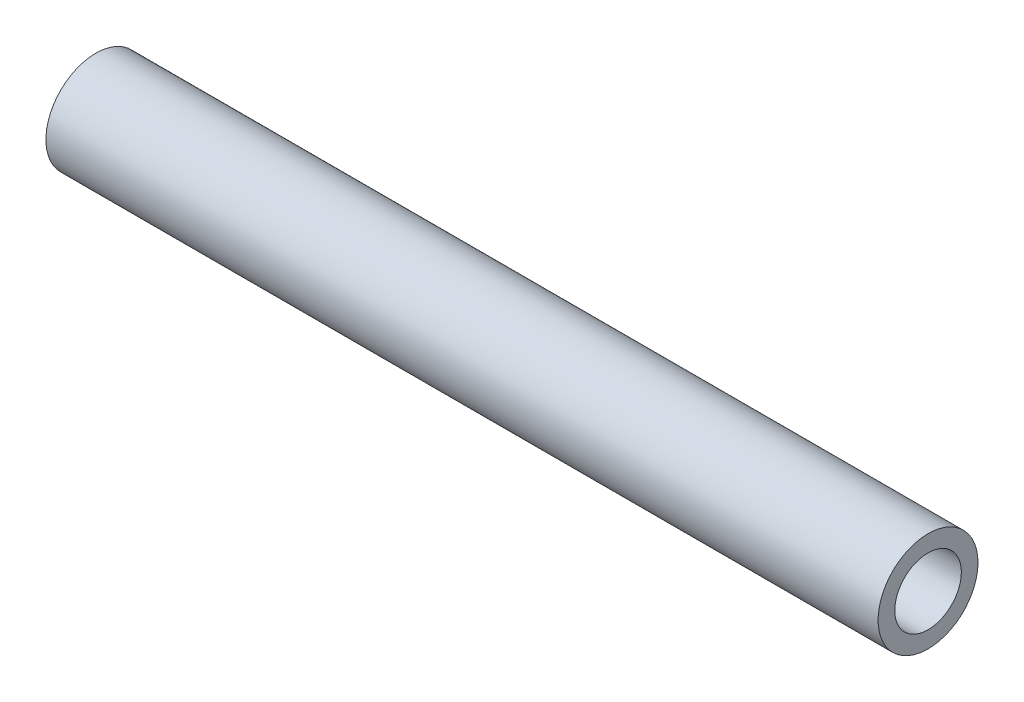
ISO-10303-21;
HEADER;
FILE_DESCRIPTION(('STEP AP214'),'2;1');
FILE_NAME('part.step','',(''),(''),'','','');
FILE_SCHEMA(('AUTOMOTIVE_DESIGN { 1 0 10303 214 1 1 1 1 }'));
ENDSEC;
DATA;
#1=APPLICATION_CONTEXT('core data for automotive mechanical design processes');
#2=APPLICATION_PROTOCOL_DEFINITION('international standard','automotive_design',2000,#1);
#3=PRODUCT_CONTEXT('',#1,'mechanical');
#4=PRODUCT('Part','Part','',(#3));
#5=PRODUCT_RELATED_PRODUCT_CATEGORY('part','',(#4));
#6=PRODUCT_DEFINITION_FORMATION('','',#4);
#7=PRODUCT_DEFINITION_CONTEXT('part definition',#1,'design');
#8=PRODUCT_DEFINITION('design','',#6,#7);
#9=PRODUCT_DEFINITION_SHAPE('','',#8);
#10=(LENGTH_UNIT() NAMED_UNIT(*) SI_UNIT(.MILLI.,.METRE.));
#11=(NAMED_UNIT(*) PLANE_ANGLE_UNIT() SI_UNIT($,.RADIAN.));
#12=(NAMED_UNIT(*) SI_UNIT($,.STERADIAN.) SOLID_ANGLE_UNIT());
#13=UNCERTAINTY_MEASURE_WITH_UNIT(LENGTH_MEASURE(1.E-05),#10,'distance_accuracy_value','');
#14=(GEOMETRIC_REPRESENTATION_CONTEXT(3) GLOBAL_UNCERTAINTY_ASSIGNED_CONTEXT((#13)) GLOBAL_UNIT_ASSIGNED_CONTEXT((#10,
#11,#12)) REPRESENTATION_CONTEXT('',''));
#15=CARTESIAN_POINT('',(0.,0.,0.));
#16=DIRECTION('',(0.,0.,1.));
#17=DIRECTION('',(1.,0.,0.));
#18=AXIS2_PLACEMENT_3D('',#15,#16,#17);
#19=CARTESIAN_POINT('',(50.,0.,0.));
#20=DIRECTION('',(1.,0.,0.));
#21=DIRECTION('',(0.,0.,-1.));
#22=AXIS2_PLACEMENT_3D('',#19,#20,#21);
#23=PLANE('',#22);
#24=CARTESIAN_POINT('',(50.,0.,0.));
#25=DIRECTION('',(1.,0.,0.));
#26=DIRECTION('',(0.,0.,-1.));
#27=AXIS2_PLACEMENT_3D('',#24,#25,#26);
#28=CIRCLE('',#27,6.);
#29=CARTESIAN_POINT('',(50.,0.,-6.));
#30=VERTEX_POINT('',#29);
#31=EDGE_CURVE('E10',#30,#30,#28,.T.);
#32=ORIENTED_EDGE('',*,*,#31,.T.);
#33=EDGE_LOOP('',(#32));
#34=FACE_BOUND('',#33,.T.);
#35=CARTESIAN_POINT('',(50.,0.,0.));
#36=DIRECTION('',(1.,0.,0.));
#37=DIRECTION('',(0.,0.,-1.));
#38=AXIS2_PLACEMENT_3D('',#35,#36,#37);
#39=CIRCLE('',#38,4.);
#40=CARTESIAN_POINT('',(50.,0.,-4.));
#41=VERTEX_POINT('',#40);
#42=EDGE_CURVE('E44',#41,#41,#39,.T.);
#43=ORIENTED_EDGE('',*,*,#42,.F.);
#44=EDGE_LOOP('',(#43));
#45=FACE_BOUND('',#44,.T.);
#46=ADVANCED_FACE('F33',(#34,#45),#23,.T.);
#47=CARTESIAN_POINT('',(-50.,0.,0.));
#48=DIRECTION('',(1.,0.,0.));
#49=DIRECTION('',(0.,0.,-1.));
#50=AXIS2_PLACEMENT_3D('',#47,#48,#49);
#51=PLANE('',#50);
#52=CARTESIAN_POINT('',(-50.,0.,0.));
#53=DIRECTION('',(1.,0.,0.));
#54=DIRECTION('',(0.,0.,-1.));
#55=AXIS2_PLACEMENT_3D('',#52,#53,#54);
#56=CIRCLE('',#55,6.);
#57=CARTESIAN_POINT('',(-50.,0.,-6.));
#58=VERTEX_POINT('',#57);
#59=EDGE_CURVE('E37',#58,#58,#56,.T.);
#60=ORIENTED_EDGE('',*,*,#59,.F.);
#61=EDGE_LOOP('',(#60));
#62=FACE_BOUND('',#61,.T.);
#63=CARTESIAN_POINT('',(-50.,0.,0.));
#64=DIRECTION('',(1.,0.,0.));
#65=DIRECTION('',(0.,0.,-1.));
#66=AXIS2_PLACEMENT_3D('',#63,#64,#65);
#67=CIRCLE('',#66,4.);
#68=CARTESIAN_POINT('',(-50.,0.,-4.));
#69=VERTEX_POINT('',#68);
#70=EDGE_CURVE('E46',#69,#69,#67,.T.);
#71=ORIENTED_EDGE('',*,*,#70,.T.);
#72=EDGE_LOOP('',(#71));
#73=FACE_BOUND('',#72,.T.);
#74=ADVANCED_FACE('F56',(#62,#73),#51,.F.);
#75=CARTESIAN_POINT('',(50.,0.,0.));
#76=DIRECTION('',(-1.,0.,0.));
#77=DIRECTION('',(0.,0.,1.));
#78=AXIS2_PLACEMENT_3D('',#75,#76,#77);
#79=CYLINDRICAL_SURFACE('',#78,6.);
#80=ORIENTED_EDGE('',*,*,#31,.F.);
#81=EDGE_LOOP('',(#80));
#82=FACE_BOUND('',#81,.T.);
#83=ORIENTED_EDGE('',*,*,#59,.T.);
#84=EDGE_LOOP('',(#83));
#85=FACE_BOUND('',#84,.T.);
#86=ADVANCED_FACE('F35',(#82,#85),#79,.T.);
#87=CARTESIAN_POINT('',(50.,0.,0.));
#88=DIRECTION('',(-1.,0.,0.));
#89=DIRECTION('',(0.,0.,1.));
#90=AXIS2_PLACEMENT_3D('',#87,#88,#89);
#91=CYLINDRICAL_SURFACE('',#90,4.);
#92=ORIENTED_EDGE('',*,*,#42,.T.);
#93=EDGE_LOOP('',(#92));
#94=FACE_BOUND('',#93,.T.);
#95=ORIENTED_EDGE('',*,*,#70,.F.);
#96=EDGE_LOOP('',(#95));
#97=FACE_BOUND('',#96,.T.);
#98=ADVANCED_FACE('F52',(#94,#97),#91,.F.);
#99=CLOSED_SHELL('',(#46,#74,#86,#98));
#100=MANIFOLD_SOLID_BREP('B2',#99);
#101=ADVANCED_BREP_SHAPE_REPRESENTATION('',(#18,#100),#14);
#102=SHAPE_DEFINITION_REPRESENTATION(#9,#101);
ENDSEC;
END-ISO-10303-21;
